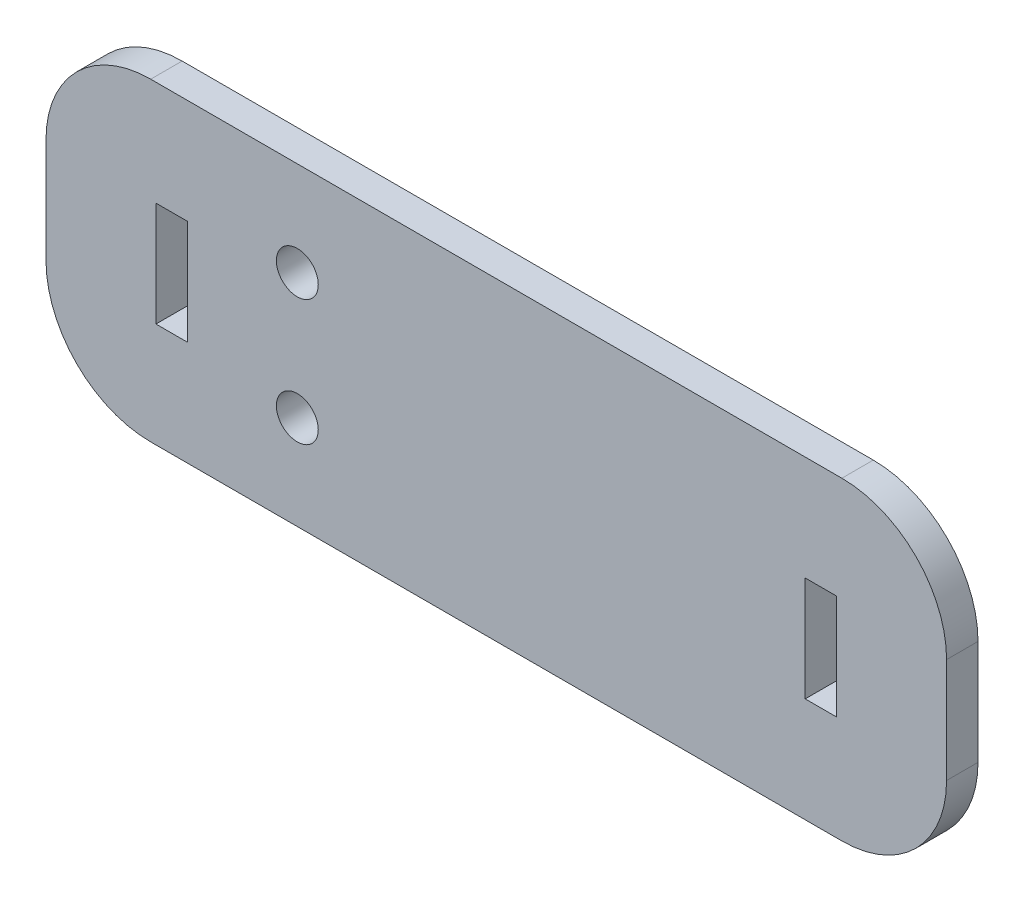
ISO-10303-21;
HEADER;
FILE_DESCRIPTION(('STEP AP214'),'2;1');
FILE_NAME('part.step','',(''),(''),'','','');
FILE_SCHEMA(('AUTOMOTIVE_DESIGN { 1 0 10303 214 1 1 1 1 }'));
ENDSEC;
DATA;
#1=APPLICATION_CONTEXT('core data for automotive mechanical design processes');
#2=APPLICATION_PROTOCOL_DEFINITION('international standard','automotive_design',2000,#1);
#3=PRODUCT_CONTEXT('',#1,'mechanical');
#4=PRODUCT('Part','Part','',(#3));
#5=PRODUCT_RELATED_PRODUCT_CATEGORY('part','',(#4));
#6=PRODUCT_DEFINITION_FORMATION('','',#4);
#7=PRODUCT_DEFINITION_CONTEXT('part definition',#1,'design');
#8=PRODUCT_DEFINITION('design','',#6,#7);
#9=PRODUCT_DEFINITION_SHAPE('','',#8);
#10=(LENGTH_UNIT() NAMED_UNIT(*) SI_UNIT(.MILLI.,.METRE.));
#11=(NAMED_UNIT(*) PLANE_ANGLE_UNIT() SI_UNIT($,.RADIAN.));
#12=(NAMED_UNIT(*) SI_UNIT($,.STERADIAN.) SOLID_ANGLE_UNIT());
#13=UNCERTAINTY_MEASURE_WITH_UNIT(LENGTH_MEASURE(1.E-05),#10,'distance_accuracy_value','');
#14=(GEOMETRIC_REPRESENTATION_CONTEXT(3) GLOBAL_UNCERTAINTY_ASSIGNED_CONTEXT((#13)) GLOBAL_UNIT_ASSIGNED_CONTEXT((#10,
#11,#12)) REPRESENTATION_CONTEXT('',''));
#15=CARTESIAN_POINT('',(0.,0.,0.));
#16=DIRECTION('',(0.,0.,1.));
#17=DIRECTION('',(1.,0.,0.));
#18=AXIS2_PLACEMENT_3D('',#15,#16,#17);
#19=CARTESIAN_POINT('',(43.,15.,3.));
#20=DIRECTION('',(-1.,0.,0.));
#21=DIRECTION('',(0.,-1.,0.));
#22=AXIS2_PLACEMENT_3D('',#19,#20,#21);
#23=PLANE('',#22);
#24=DIRECTION('',(0.,1.,0.));
#25=VECTOR('',#24,1.);
#26=CARTESIAN_POINT('',(43.,15.,3.));
#27=LINE('',#26,#25);
#28=CARTESIAN_POINT('',(43.,-5.,3.));
#29=VERTEX_POINT('',#28);
#30=CARTESIAN_POINT('',(43.,5.,3.));
#31=VERTEX_POINT('',#30);
#32=EDGE_CURVE('E270',#29,#31,#27,.T.);
#33=ORIENTED_EDGE('',*,*,#32,.F.);
#34=DIRECTION('',(0.,0.,-1.));
#35=VECTOR('',#34,1.);
#36=CARTESIAN_POINT('',(43.,-5.,3.));
#37=LINE('',#36,#35);
#38=CARTESIAN_POINT('',(43.,-5.,0.));
#39=VERTEX_POINT('',#38);
#40=EDGE_CURVE('E301',#29,#39,#37,.T.);
#41=ORIENTED_EDGE('',*,*,#40,.T.);
#42=DIRECTION('',(0.,1.,0.));
#43=VECTOR('',#42,1.);
#44=CARTESIAN_POINT('',(43.,15.,0.));
#45=LINE('',#44,#43);
#46=CARTESIAN_POINT('',(43.,5.,0.));
#47=VERTEX_POINT('',#46);
#48=EDGE_CURVE('E178',#39,#47,#45,.T.);
#49=ORIENTED_EDGE('',*,*,#48,.T.);
#50=DIRECTION('',(0.,0.,-1.));
#51=VECTOR('',#50,1.);
#52=CARTESIAN_POINT('',(43.,5.,3.));
#53=LINE('',#52,#51);
#54=EDGE_CURVE('E285',#47,#31,#53,.F.);
#55=ORIENTED_EDGE('',*,*,#54,.T.);
#56=EDGE_LOOP('',(#33,#41,#49,#55));
#57=FACE_BOUND('',#56,.T.);
#58=ADVANCED_FACE('F42',(#57),#23,.F.);
#59=CARTESIAN_POINT('',(-43.,15.,3.));
#60=DIRECTION('',(0.,-1.,0.));
#61=DIRECTION('',(0.,0.,-1.));
#62=AXIS2_PLACEMENT_3D('',#59,#60,#61);
#63=PLANE('',#62);
#64=DIRECTION('',(-1.,0.,0.));
#65=VECTOR('',#64,1.);
#66=CARTESIAN_POINT('',(-43.,15.,3.));
#67=LINE('',#66,#65);
#68=CARTESIAN_POINT('',(33.,15.,3.));
#69=VERTEX_POINT('',#68);
#70=CARTESIAN_POINT('',(-33.,15.,3.));
#71=VERTEX_POINT('',#70);
#72=EDGE_CURVE('E274',#69,#71,#67,.T.);
#73=ORIENTED_EDGE('',*,*,#72,.F.);
#74=DIRECTION('',(0.,0.,-1.));
#75=VECTOR('',#74,1.);
#76=CARTESIAN_POINT('',(33.,15.,3.));
#77=LINE('',#76,#75);
#78=CARTESIAN_POINT('',(33.,15.,0.));
#79=VERTEX_POINT('',#78);
#80=EDGE_CURVE('E338',#69,#79,#77,.T.);
#81=ORIENTED_EDGE('',*,*,#80,.T.);
#82=DIRECTION('',(-1.,0.,0.));
#83=VECTOR('',#82,1.);
#84=CARTESIAN_POINT('',(-43.,15.,0.));
#85=LINE('',#84,#83);
#86=CARTESIAN_POINT('',(-33.,15.,0.));
#87=VERTEX_POINT('',#86);
#88=EDGE_CURVE('E289',#79,#87,#85,.T.);
#89=ORIENTED_EDGE('',*,*,#88,.T.);
#90=DIRECTION('',(0.,0.,-1.));
#91=VECTOR('',#90,1.);
#92=CARTESIAN_POINT('',(-33.,15.,3.));
#93=LINE('',#92,#91);
#94=EDGE_CURVE('E335',#87,#71,#93,.F.);
#95=ORIENTED_EDGE('',*,*,#94,.T.);
#96=EDGE_LOOP('',(#73,#81,#89,#95));
#97=FACE_BOUND('',#96,.T.);
#98=ADVANCED_FACE('F373',(#97),#63,.F.);
#99=CARTESIAN_POINT('',(-43.,15.,3.));
#100=DIRECTION('',(1.,0.,0.));
#101=DIRECTION('',(0.,0.,-1.));
#102=AXIS2_PLACEMENT_3D('',#99,#100,#101);
#103=PLANE('',#102);
#104=DIRECTION('',(0.,-1.,0.));
#105=VECTOR('',#104,1.);
#106=CARTESIAN_POINT('',(-43.,15.,0.));
#107=LINE('',#106,#105);
#108=CARTESIAN_POINT('',(-43.,5.,0.));
#109=VERTEX_POINT('',#108);
#110=CARTESIAN_POINT('',(-43.,-5.,0.));
#111=VERTEX_POINT('',#110);
#112=EDGE_CURVE('E293',#109,#111,#107,.T.);
#113=ORIENTED_EDGE('',*,*,#112,.T.);
#114=DIRECTION('',(0.,0.,-1.));
#115=VECTOR('',#114,1.);
#116=CARTESIAN_POINT('',(-43.,-5.,3.));
#117=LINE('',#116,#115);
#118=CARTESIAN_POINT('',(-43.,-5.,3.));
#119=VERTEX_POINT('',#118);
#120=EDGE_CURVE('E11',#111,#119,#117,.F.);
#121=ORIENTED_EDGE('',*,*,#120,.T.);
#122=DIRECTION('',(0.,-1.,0.));
#123=VECTOR('',#122,1.);
#124=CARTESIAN_POINT('',(-43.,15.,3.));
#125=LINE('',#124,#123);
#126=CARTESIAN_POINT('',(-43.,5.,3.));
#127=VERTEX_POINT('',#126);
#128=EDGE_CURVE('E278',#127,#119,#125,.T.);
#129=ORIENTED_EDGE('',*,*,#128,.F.);
#130=DIRECTION('',(0.,0.,-1.));
#131=VECTOR('',#130,1.);
#132=CARTESIAN_POINT('',(-43.,5.,3.));
#133=LINE('',#132,#131);
#134=EDGE_CURVE('E51',#127,#109,#133,.T.);
#135=ORIENTED_EDGE('',*,*,#134,.T.);
#136=EDGE_LOOP('',(#113,#121,#129,#135));
#137=FACE_BOUND('',#136,.T.);
#138=ADVANCED_FACE('F345',(#137),#103,.F.);
#139=CARTESIAN_POINT('',(-43.,-15.,3.));
#140=DIRECTION('',(0.,1.,0.));
#141=DIRECTION('',(0.,0.,1.));
#142=AXIS2_PLACEMENT_3D('',#139,#140,#141);
#143=PLANE('',#142);
#144=DIRECTION('',(1.,0.,0.));
#145=VECTOR('',#144,1.);
#146=CARTESIAN_POINT('',(-43.,-15.,0.));
#147=LINE('',#146,#145);
#148=CARTESIAN_POINT('',(-33.,-15.,0.));
#149=VERTEX_POINT('',#148);
#150=CARTESIAN_POINT('',(33.,-15.,0.));
#151=VERTEX_POINT('',#150);
#152=EDGE_CURVE('E275',#149,#151,#147,.T.);
#153=ORIENTED_EDGE('',*,*,#152,.T.);
#154=DIRECTION('',(0.,0.,-1.));
#155=VECTOR('',#154,1.);
#156=CARTESIAN_POINT('',(33.,-15.,3.));
#157=LINE('',#156,#155);
#158=CARTESIAN_POINT('',(33.,-15.,3.));
#159=VERTEX_POINT('',#158);
#160=EDGE_CURVE('E321',#151,#159,#157,.F.);
#161=ORIENTED_EDGE('',*,*,#160,.T.);
#162=DIRECTION('',(1.,0.,0.));
#163=VECTOR('',#162,1.);
#164=CARTESIAN_POINT('',(-43.,-15.,3.));
#165=LINE('',#164,#163);
#166=CARTESIAN_POINT('',(-33.,-15.,3.));
#167=VERTEX_POINT('',#166);
#168=EDGE_CURVE('E281',#167,#159,#165,.T.);
#169=ORIENTED_EDGE('',*,*,#168,.F.);
#170=DIRECTION('',(0.,0.,-1.));
#171=VECTOR('',#170,1.);
#172=CARTESIAN_POINT('',(-33.,-15.,3.));
#173=LINE('',#172,#171);
#174=EDGE_CURVE('E317',#167,#149,#173,.T.);
#175=ORIENTED_EDGE('',*,*,#174,.T.);
#176=EDGE_LOOP('',(#153,#161,#169,#175));
#177=FACE_BOUND('',#176,.T.);
#178=ADVANCED_FACE('F357',(#177),#143,.F.);
#179=CARTESIAN_POINT('',(0.,0.,3.));
#180=DIRECTION('',(0.,0.,1.));
#181=DIRECTION('',(1.,0.,0.));
#182=AXIS2_PLACEMENT_3D('',#179,#180,#181);
#183=PLANE('',#182);
#184=DIRECTION('',(0.,1.,0.));
#185=VECTOR('',#184,1.);
#186=CARTESIAN_POINT('',(-29.5,5.,3.));
#187=LINE('',#186,#185);
#188=CARTESIAN_POINT('',(-29.5,-5.,3.));
#189=VERTEX_POINT('',#188);
#190=CARTESIAN_POINT('',(-29.5,5.,3.));
#191=VERTEX_POINT('',#190);
#192=EDGE_CURVE('E163',#189,#191,#187,.T.);
#193=ORIENTED_EDGE('',*,*,#192,.F.);
#194=DIRECTION('',(1.,0.,0.));
#195=VECTOR('',#194,1.);
#196=CARTESIAN_POINT('',(-32.5,-5.,3.));
#197=LINE('',#196,#195);
#198=CARTESIAN_POINT('',(-32.5,-5.,3.));
#199=VERTEX_POINT('',#198);
#200=EDGE_CURVE('E169',#199,#189,#197,.T.);
#201=ORIENTED_EDGE('',*,*,#200,.F.);
#202=DIRECTION('',(0.,-1.,0.));
#203=VECTOR('',#202,1.);
#204=CARTESIAN_POINT('',(-32.5,5.,3.));
#205=LINE('',#204,#203);
#206=CARTESIAN_POINT('',(-32.5,5.,3.));
#207=VERTEX_POINT('',#206);
#208=EDGE_CURVE('E197',#207,#199,#205,.T.);
#209=ORIENTED_EDGE('',*,*,#208,.F.);
#210=DIRECTION('',(-1.,0.,0.));
#211=VECTOR('',#210,1.);
#212=CARTESIAN_POINT('',(-32.5,5.,3.));
#213=LINE('',#212,#211);
#214=EDGE_CURVE('E189',#191,#207,#213,.T.);
#215=ORIENTED_EDGE('',*,*,#214,.F.);
#216=EDGE_LOOP('',(#193,#201,#209,#215));
#217=FACE_BOUND('',#216,.T.);
#218=CARTESIAN_POINT('',(-19.,-6.,3.));
#219=DIRECTION('',(0.,0.,1.));
#220=DIRECTION('',(1.,0.,0.));
#221=AXIS2_PLACEMENT_3D('',#218,#219,#220);
#222=CIRCLE('',#221,2.);
#223=CARTESIAN_POINT('',(-17.,-6.,3.));
#224=VERTEX_POINT('',#223);
#225=EDGE_CURVE('E215',#224,#224,#222,.T.);
#226=ORIENTED_EDGE('',*,*,#225,.F.);
#227=EDGE_LOOP('',(#226));
#228=FACE_BOUND('',#227,.T.);
#229=CARTESIAN_POINT('',(-19.,6.,3.));
#230=DIRECTION('',(0.,0.,1.));
#231=DIRECTION('',(1.,0.,0.));
#232=AXIS2_PLACEMENT_3D('',#229,#230,#231);
#233=CIRCLE('',#232,2.);
#234=CARTESIAN_POINT('',(-17.,6.,3.));
#235=VERTEX_POINT('',#234);
#236=EDGE_CURVE('E225',#235,#235,#233,.T.);
#237=ORIENTED_EDGE('',*,*,#236,.F.);
#238=EDGE_LOOP('',(#237));
#239=FACE_BOUND('',#238,.T.);
#240=DIRECTION('',(0.,1.,0.));
#241=VECTOR('',#240,1.);
#242=CARTESIAN_POINT('',(32.5,5.00000000000001,3.));
#243=LINE('',#242,#241);
#244=CARTESIAN_POINT('',(32.5,-4.99999999999999,3.));
#245=VERTEX_POINT('',#244);
#246=CARTESIAN_POINT('',(32.5,5.00000000000001,3.));
#247=VERTEX_POINT('',#246);
#248=EDGE_CURVE('E250',#245,#247,#243,.T.);
#249=ORIENTED_EDGE('',*,*,#248,.F.);
#250=DIRECTION('',(1.,0.,0.));
#251=VECTOR('',#250,1.);
#252=CARTESIAN_POINT('',(32.5,-4.99999999999999,3.));
#253=LINE('',#252,#251);
#254=CARTESIAN_POINT('',(29.5,-5.,3.));
#255=VERTEX_POINT('',#254);
#256=EDGE_CURVE('E230',#255,#245,#253,.T.);
#257=ORIENTED_EDGE('',*,*,#256,.F.);
#258=DIRECTION('',(0.,-1.,0.));
#259=VECTOR('',#258,1.);
#260=CARTESIAN_POINT('',(29.5,5.,3.));
#261=LINE('',#260,#259);
#262=CARTESIAN_POINT('',(29.5,5.,3.));
#263=VERTEX_POINT('',#262);
#264=EDGE_CURVE('E242',#263,#255,#261,.T.);
#265=ORIENTED_EDGE('',*,*,#264,.F.);
#266=DIRECTION('',(-1.,0.,0.));
#267=VECTOR('',#266,1.);
#268=CARTESIAN_POINT('',(32.5,5.00000000000001,3.));
#269=LINE('',#268,#267);
#270=EDGE_CURVE('E246',#247,#263,#269,.T.);
#271=ORIENTED_EDGE('',*,*,#270,.F.);
#272=EDGE_LOOP('',(#249,#257,#265,#271));
#273=FACE_BOUND('',#272,.T.);
#274=ORIENTED_EDGE('',*,*,#168,.T.);
#275=CARTESIAN_POINT('',(33.,-5.,3.));
#276=DIRECTION('',(0.,0.,1.));
#277=DIRECTION('',(1.,0.,0.));
#278=AXIS2_PLACEMENT_3D('',#275,#276,#277);
#279=CIRCLE('',#278,10.);
#280=EDGE_CURVE('E332',#159,#29,#279,.T.);
#281=ORIENTED_EDGE('',*,*,#280,.T.);
#282=ORIENTED_EDGE('',*,*,#32,.T.);
#283=CARTESIAN_POINT('',(33.,5.,3.));
#284=DIRECTION('',(0.,0.,1.));
#285=DIRECTION('',(1.,0.,0.));
#286=AXIS2_PLACEMENT_3D('',#283,#284,#285);
#287=CIRCLE('',#286,10.);
#288=EDGE_CURVE('E329',#31,#69,#287,.T.);
#289=ORIENTED_EDGE('',*,*,#288,.T.);
#290=ORIENTED_EDGE('',*,*,#72,.T.);
#291=CARTESIAN_POINT('',(-33.,5.,3.));
#292=DIRECTION('',(0.,0.,1.));
#293=DIRECTION('',(1.,0.,0.));
#294=AXIS2_PLACEMENT_3D('',#291,#292,#293);
#295=CIRCLE('',#294,10.);
#296=EDGE_CURVE('E63',#71,#127,#295,.T.);
#297=ORIENTED_EDGE('',*,*,#296,.T.);
#298=ORIENTED_EDGE('',*,*,#128,.T.);
#299=CARTESIAN_POINT('',(-33.,-5.,3.));
#300=DIRECTION('',(0.,0.,1.));
#301=DIRECTION('',(1.,0.,0.));
#302=AXIS2_PLACEMENT_3D('',#299,#300,#301);
#303=CIRCLE('',#302,10.);
#304=EDGE_CURVE('E326',#119,#167,#303,.T.);
#305=ORIENTED_EDGE('',*,*,#304,.T.);
#306=EDGE_LOOP('',(#274,#281,#282,#289,#290,#297,#298,#305));
#307=FACE_BOUND('',#306,.T.);
#308=ADVANCED_FACE('F360',(#217,#228,#239,#273,#307),#183,.T.);
#309=CARTESIAN_POINT('',(0.,0.,0.));
#310=DIRECTION('',(0.,0.,1.));
#311=DIRECTION('',(1.,0.,0.));
#312=AXIS2_PLACEMENT_3D('',#309,#310,#311);
#313=PLANE('',#312);
#314=DIRECTION('',(-1.,0.,0.));
#315=VECTOR('',#314,1.);
#316=CARTESIAN_POINT('',(-32.5,-5.,0.));
#317=LINE('',#316,#315);
#318=CARTESIAN_POINT('',(-29.5,-5.,0.));
#319=VERTEX_POINT('',#318);
#320=CARTESIAN_POINT('',(-32.5,-5.,0.));
#321=VERTEX_POINT('',#320);
#322=EDGE_CURVE('E184',#319,#321,#317,.T.);
#323=ORIENTED_EDGE('',*,*,#322,.F.);
#324=DIRECTION('',(0.,-1.,0.));
#325=VECTOR('',#324,1.);
#326=CARTESIAN_POINT('',(-29.5,5.,0.));
#327=LINE('',#326,#325);
#328=CARTESIAN_POINT('',(-29.5,5.,0.));
#329=VERTEX_POINT('',#328);
#330=EDGE_CURVE('E160',#329,#319,#327,.T.);
#331=ORIENTED_EDGE('',*,*,#330,.F.);
#332=DIRECTION('',(1.,0.,0.));
#333=VECTOR('',#332,1.);
#334=CARTESIAN_POINT('',(-32.5,5.,0.));
#335=LINE('',#334,#333);
#336=CARTESIAN_POINT('',(-32.5,5.,0.));
#337=VERTEX_POINT('',#336);
#338=EDGE_CURVE('E173',#337,#329,#335,.T.);
#339=ORIENTED_EDGE('',*,*,#338,.F.);
#340=DIRECTION('',(0.,1.,0.));
#341=VECTOR('',#340,1.);
#342=CARTESIAN_POINT('',(-32.5,5.,0.));
#343=LINE('',#342,#341);
#344=EDGE_CURVE('E191',#321,#337,#343,.T.);
#345=ORIENTED_EDGE('',*,*,#344,.F.);
#346=EDGE_LOOP('',(#323,#331,#339,#345));
#347=FACE_BOUND('',#346,.T.);
#348=CARTESIAN_POINT('',(-19.,-6.,0.));
#349=DIRECTION('',(0.,0.,1.));
#350=DIRECTION('',(1.,0.,0.));
#351=AXIS2_PLACEMENT_3D('',#348,#349,#350);
#352=CIRCLE('',#351,2.);
#353=CARTESIAN_POINT('',(-17.,-6.,0.));
#354=VERTEX_POINT('',#353);
#355=EDGE_CURVE('E211',#354,#354,#352,.F.);
#356=ORIENTED_EDGE('',*,*,#355,.F.);
#357=EDGE_LOOP('',(#356));
#358=FACE_BOUND('',#357,.T.);
#359=CARTESIAN_POINT('',(-19.,6.,0.));
#360=DIRECTION('',(0.,0.,1.));
#361=DIRECTION('',(1.,0.,0.));
#362=AXIS2_PLACEMENT_3D('',#359,#360,#361);
#363=CIRCLE('',#362,2.);
#364=CARTESIAN_POINT('',(-17.,6.,0.));
#365=VERTEX_POINT('',#364);
#366=EDGE_CURVE('E219',#365,#365,#363,.F.);
#367=ORIENTED_EDGE('',*,*,#366,.F.);
#368=EDGE_LOOP('',(#367));
#369=FACE_BOUND('',#368,.T.);
#370=DIRECTION('',(-1.,0.,0.));
#371=VECTOR('',#370,1.);
#372=CARTESIAN_POINT('',(32.5,-4.99999999999999,0.));
#373=LINE('',#372,#371);
#374=CARTESIAN_POINT('',(32.5,-4.99999999999999,0.));
#375=VERTEX_POINT('',#374);
#376=CARTESIAN_POINT('',(29.5,-5.,0.));
#377=VERTEX_POINT('',#376);
#378=EDGE_CURVE('E257',#375,#377,#373,.T.);
#379=ORIENTED_EDGE('',*,*,#378,.F.);
#380=DIRECTION('',(0.,-1.,0.));
#381=VECTOR('',#380,1.);
#382=CARTESIAN_POINT('',(32.5,5.00000000000001,0.));
#383=LINE('',#382,#381);
#384=CARTESIAN_POINT('',(32.5,5.00000000000001,0.));
#385=VERTEX_POINT('',#384);
#386=EDGE_CURVE('E253',#385,#375,#383,.T.);
#387=ORIENTED_EDGE('',*,*,#386,.F.);
#388=DIRECTION('',(1.,0.,0.));
#389=VECTOR('',#388,1.);
#390=CARTESIAN_POINT('',(32.5,5.00000000000001,0.));
#391=LINE('',#390,#389);
#392=CARTESIAN_POINT('',(29.5,5.,0.));
#393=VERTEX_POINT('',#392);
#394=EDGE_CURVE('E220',#393,#385,#391,.T.);
#395=ORIENTED_EDGE('',*,*,#394,.F.);
#396=DIRECTION('',(0.,1.,0.));
#397=VECTOR('',#396,1.);
#398=CARTESIAN_POINT('',(29.5,5.,0.));
#399=LINE('',#398,#397);
#400=EDGE_CURVE('E261',#377,#393,#399,.T.);
#401=ORIENTED_EDGE('',*,*,#400,.F.);
#402=EDGE_LOOP('',(#379,#387,#395,#401));
#403=FACE_BOUND('',#402,.T.);
#404=ORIENTED_EDGE('',*,*,#48,.F.);
#405=CARTESIAN_POINT('',(33.,-5.,0.));
#406=DIRECTION('',(0.,0.,1.));
#407=DIRECTION('',(1.,0.,0.));
#408=AXIS2_PLACEMENT_3D('',#405,#406,#407);
#409=CIRCLE('',#408,10.);
#410=EDGE_CURVE('E314',#39,#151,#409,.F.);
#411=ORIENTED_EDGE('',*,*,#410,.T.);
#412=ORIENTED_EDGE('',*,*,#152,.F.);
#413=CARTESIAN_POINT('',(-33.,-5.,0.));
#414=DIRECTION('',(0.,0.,1.));
#415=DIRECTION('',(1.,0.,0.));
#416=AXIS2_PLACEMENT_3D('',#413,#414,#415);
#417=CIRCLE('',#416,10.);
#418=EDGE_CURVE('E308',#149,#111,#417,.F.);
#419=ORIENTED_EDGE('',*,*,#418,.T.);
#420=ORIENTED_EDGE('',*,*,#112,.F.);
#421=CARTESIAN_POINT('',(-33.,5.,0.));
#422=DIRECTION('',(0.,0.,1.));
#423=DIRECTION('',(1.,0.,0.));
#424=AXIS2_PLACEMENT_3D('',#421,#422,#423);
#425=CIRCLE('',#424,10.);
#426=EDGE_CURVE('E305',#109,#87,#425,.F.);
#427=ORIENTED_EDGE('',*,*,#426,.T.);
#428=ORIENTED_EDGE('',*,*,#88,.F.);
#429=CARTESIAN_POINT('',(33.,5.,0.));
#430=DIRECTION('',(0.,0.,1.));
#431=DIRECTION('',(1.,0.,0.));
#432=AXIS2_PLACEMENT_3D('',#429,#430,#431);
#433=CIRCLE('',#432,10.);
#434=EDGE_CURVE('E311',#79,#47,#433,.F.);
#435=ORIENTED_EDGE('',*,*,#434,.T.);
#436=EDGE_LOOP('',(#404,#411,#412,#419,#420,#427,#428,#435));
#437=FACE_BOUND('',#436,.T.);
#438=ADVANCED_FACE('F181',(#347,#358,#369,#403,#437),#313,.F.);
#439=CARTESIAN_POINT('',(32.5,5.00000000000001,-0.00100000000000013));
#440=DIRECTION('',(1.,0.,0.));
#441=DIRECTION('',(0.,0.,-1.));
#442=AXIS2_PLACEMENT_3D('',#439,#440,#441);
#443=PLANE('',#442);
#444=ORIENTED_EDGE('',*,*,#386,.T.);
#445=DIRECTION('',(0.,0.,1.));
#446=VECTOR('',#445,1.);
#447=CARTESIAN_POINT('',(32.5,-4.99999999999999,-0.00100000000000013));
#448=LINE('',#447,#446);
#449=EDGE_CURVE('E224',#375,#245,#448,.T.);
#450=ORIENTED_EDGE('',*,*,#449,.T.);
#451=ORIENTED_EDGE('',*,*,#248,.T.);
#452=DIRECTION('',(0.,0.,1.));
#453=VECTOR('',#452,1.);
#454=CARTESIAN_POINT('',(32.5,5.00000000000001,-0.00100000000000013));
#455=LINE('',#454,#453);
#456=EDGE_CURVE('E226',#385,#247,#455,.T.);
#457=ORIENTED_EDGE('',*,*,#456,.F.);
#458=EDGE_LOOP('',(#444,#450,#451,#457));
#459=FACE_BOUND('',#458,.T.);
#460=ADVANCED_FACE('F501',(#459),#443,.F.);
#461=CARTESIAN_POINT('',(32.5,-4.99999999999999,-0.00100000000000013));
#462=DIRECTION('',(0.,-1.,0.));
#463=DIRECTION('',(1.,0.,0.));
#464=AXIS2_PLACEMENT_3D('',#461,#462,#463);
#465=PLANE('',#464);
#466=ORIENTED_EDGE('',*,*,#378,.T.);
#467=DIRECTION('',(0.,0.,1.));
#468=VECTOR('',#467,1.);
#469=CARTESIAN_POINT('',(29.5,-5.,-0.00100000000000013));
#470=LINE('',#469,#468);
#471=EDGE_CURVE('E234',#377,#255,#470,.T.);
#472=ORIENTED_EDGE('',*,*,#471,.T.);
#473=ORIENTED_EDGE('',*,*,#256,.T.);
#474=ORIENTED_EDGE('',*,*,#449,.F.);
#475=EDGE_LOOP('',(#466,#472,#473,#474));
#476=FACE_BOUND('',#475,.T.);
#477=ADVANCED_FACE('F491',(#476),#465,.F.);
#478=CARTESIAN_POINT('',(29.5,5.,-0.00100000000000013));
#479=DIRECTION('',(-1.,0.,0.));
#480=DIRECTION('',(0.,0.,1.));
#481=AXIS2_PLACEMENT_3D('',#478,#479,#480);
#482=PLANE('',#481);
#483=ORIENTED_EDGE('',*,*,#400,.T.);
#484=DIRECTION('',(0.,0.,1.));
#485=VECTOR('',#484,1.);
#486=CARTESIAN_POINT('',(29.5,5.,-0.00100000000000013));
#487=LINE('',#486,#485);
#488=EDGE_CURVE('E231',#393,#263,#487,.T.);
#489=ORIENTED_EDGE('',*,*,#488,.T.);
#490=ORIENTED_EDGE('',*,*,#264,.T.);
#491=ORIENTED_EDGE('',*,*,#471,.F.);
#492=EDGE_LOOP('',(#483,#489,#490,#491));
#493=FACE_BOUND('',#492,.T.);
#494=ADVANCED_FACE('F481',(#493),#482,.F.);
#495=CARTESIAN_POINT('',(32.5,5.00000000000001,-0.00100000000000013));
#496=DIRECTION('',(0.,1.,0.));
#497=DIRECTION('',(-1.,0.,0.));
#498=AXIS2_PLACEMENT_3D('',#495,#496,#497);
#499=PLANE('',#498);
#500=ORIENTED_EDGE('',*,*,#394,.T.);
#501=ORIENTED_EDGE('',*,*,#456,.T.);
#502=ORIENTED_EDGE('',*,*,#270,.T.);
#503=ORIENTED_EDGE('',*,*,#488,.F.);
#504=EDGE_LOOP('',(#500,#501,#502,#503));
#505=FACE_BOUND('',#504,.T.);
#506=ADVANCED_FACE('F471',(#505),#499,.F.);
#507=CARTESIAN_POINT('',(-19.,6.,-0.00100000000000013));
#508=DIRECTION('',(0.,0.,1.));
#509=DIRECTION('',(1.,0.,0.));
#510=AXIS2_PLACEMENT_3D('',#507,#508,#509);
#511=CYLINDRICAL_SURFACE('',#510,2.);
#512=ORIENTED_EDGE('',*,*,#236,.T.);
#513=EDGE_LOOP('',(#512));
#514=FACE_BOUND('',#513,.T.);
#515=ORIENTED_EDGE('',*,*,#366,.T.);
#516=EDGE_LOOP('',(#515));
#517=FACE_BOUND('',#516,.T.);
#518=ADVANCED_FACE('F461',(#514,#517),#511,.F.);
#519=CARTESIAN_POINT('',(-19.,-6.,-0.00100000000000013));
#520=DIRECTION('',(0.,0.,1.));
#521=DIRECTION('',(1.,0.,0.));
#522=AXIS2_PLACEMENT_3D('',#519,#520,#521);
#523=CYLINDRICAL_SURFACE('',#522,2.);
#524=ORIENTED_EDGE('',*,*,#225,.T.);
#525=EDGE_LOOP('',(#524));
#526=FACE_BOUND('',#525,.T.);
#527=ORIENTED_EDGE('',*,*,#355,.T.);
#528=EDGE_LOOP('',(#527));
#529=FACE_BOUND('',#528,.T.);
#530=ADVANCED_FACE('F452',(#526,#529),#523,.F.);
#531=CARTESIAN_POINT('',(-29.5,5.,-0.00100000000000013));
#532=DIRECTION('',(1.,0.,0.));
#533=DIRECTION('',(0.,0.,-1.));
#534=AXIS2_PLACEMENT_3D('',#531,#532,#533);
#535=PLANE('',#534);
#536=ORIENTED_EDGE('',*,*,#330,.T.);
#537=DIRECTION('',(0.,0.,1.));
#538=VECTOR('',#537,1.);
#539=CARTESIAN_POINT('',(-29.5,-5.,-0.00100000000000013));
#540=LINE('',#539,#538);
#541=EDGE_CURVE('E179',#319,#189,#540,.T.);
#542=ORIENTED_EDGE('',*,*,#541,.T.);
#543=ORIENTED_EDGE('',*,*,#192,.T.);
#544=DIRECTION('',(0.,0.,1.));
#545=VECTOR('',#544,1.);
#546=CARTESIAN_POINT('',(-29.5,5.,-0.00100000000000013));
#547=LINE('',#546,#545);
#548=EDGE_CURVE('E156',#329,#191,#547,.T.);
#549=ORIENTED_EDGE('',*,*,#548,.F.);
#550=EDGE_LOOP('',(#536,#542,#543,#549));
#551=FACE_BOUND('',#550,.T.);
#552=ADVANCED_FACE('F158',(#551),#535,.F.);
#553=CARTESIAN_POINT('',(-32.5,-5.,-0.00100000000000013));
#554=DIRECTION('',(0.,-1.,0.));
#555=DIRECTION('',(0.,0.,-1.));
#556=AXIS2_PLACEMENT_3D('',#553,#554,#555);
#557=PLANE('',#556);
#558=ORIENTED_EDGE('',*,*,#322,.T.);
#559=DIRECTION('',(0.,0.,1.));
#560=VECTOR('',#559,1.);
#561=CARTESIAN_POINT('',(-32.5,-5.,-0.00100000000000013));
#562=LINE('',#561,#560);
#563=EDGE_CURVE('E206',#321,#199,#562,.T.);
#564=ORIENTED_EDGE('',*,*,#563,.T.);
#565=ORIENTED_EDGE('',*,*,#200,.T.);
#566=ORIENTED_EDGE('',*,*,#541,.F.);
#567=EDGE_LOOP('',(#558,#564,#565,#566));
#568=FACE_BOUND('',#567,.T.);
#569=ADVANCED_FACE('F433',(#568),#557,.F.);
#570=CARTESIAN_POINT('',(-32.5,5.,-0.00100000000000013));
#571=DIRECTION('',(-1.,0.,0.));
#572=DIRECTION('',(0.,-1.,0.));
#573=AXIS2_PLACEMENT_3D('',#570,#571,#572);
#574=PLANE('',#573);
#575=ORIENTED_EDGE('',*,*,#344,.T.);
#576=DIRECTION('',(0.,0.,1.));
#577=VECTOR('',#576,1.);
#578=CARTESIAN_POINT('',(-32.5,5.,-0.00100000000000013));
#579=LINE('',#578,#577);
#580=EDGE_CURVE('E168',#337,#207,#579,.T.);
#581=ORIENTED_EDGE('',*,*,#580,.T.);
#582=ORIENTED_EDGE('',*,*,#208,.T.);
#583=ORIENTED_EDGE('',*,*,#563,.F.);
#584=EDGE_LOOP('',(#575,#581,#582,#583));
#585=FACE_BOUND('',#584,.T.);
#586=ADVANCED_FACE('F424',(#585),#574,.F.);
#587=CARTESIAN_POINT('',(-32.5,5.,-0.00100000000000013));
#588=DIRECTION('',(0.,1.,0.));
#589=DIRECTION('',(0.,0.,1.));
#590=AXIS2_PLACEMENT_3D('',#587,#588,#589);
#591=PLANE('',#590);
#592=ORIENTED_EDGE('',*,*,#338,.T.);
#593=ORIENTED_EDGE('',*,*,#548,.T.);
#594=ORIENTED_EDGE('',*,*,#214,.T.);
#595=ORIENTED_EDGE('',*,*,#580,.F.);
#596=EDGE_LOOP('',(#592,#593,#594,#595));
#597=FACE_BOUND('',#596,.T.);
#598=ADVANCED_FACE('F174',(#597),#591,.F.);
#599=CARTESIAN_POINT('',(33.,-5.,3.));
#600=DIRECTION('',(0.,0.,-1.));
#601=DIRECTION('',(-1.,0.,0.));
#602=AXIS2_PLACEMENT_3D('',#599,#600,#601);
#603=CYLINDRICAL_SURFACE('',#602,10.);
#604=ORIENTED_EDGE('',*,*,#280,.F.);
#605=ORIENTED_EDGE('',*,*,#160,.F.);
#606=ORIENTED_EDGE('',*,*,#410,.F.);
#607=ORIENTED_EDGE('',*,*,#40,.F.);
#608=EDGE_LOOP('',(#604,#605,#606,#607));
#609=FACE_BOUND('',#608,.T.);
#610=ADVANCED_FACE('F364',(#609),#603,.T.);
#611=CARTESIAN_POINT('',(33.,5.,3.));
#612=DIRECTION('',(0.,0.,-1.));
#613=DIRECTION('',(-1.,0.,0.));
#614=AXIS2_PLACEMENT_3D('',#611,#612,#613);
#615=CYLINDRICAL_SURFACE('',#614,10.);
#616=ORIENTED_EDGE('',*,*,#288,.F.);
#617=ORIENTED_EDGE('',*,*,#54,.F.);
#618=ORIENTED_EDGE('',*,*,#434,.F.);
#619=ORIENTED_EDGE('',*,*,#80,.F.);
#620=EDGE_LOOP('',(#616,#617,#618,#619));
#621=FACE_BOUND('',#620,.T.);
#622=ADVANCED_FACE('F370',(#621),#615,.T.);
#623=CARTESIAN_POINT('',(-33.,-5.,3.));
#624=DIRECTION('',(0.,0.,-1.));
#625=DIRECTION('',(-1.,0.,0.));
#626=AXIS2_PLACEMENT_3D('',#623,#624,#625);
#627=CYLINDRICAL_SURFACE('',#626,10.);
#628=ORIENTED_EDGE('',*,*,#304,.F.);
#629=ORIENTED_EDGE('',*,*,#120,.F.);
#630=ORIENTED_EDGE('',*,*,#418,.F.);
#631=ORIENTED_EDGE('',*,*,#174,.F.);
#632=EDGE_LOOP('',(#628,#629,#630,#631));
#633=FACE_BOUND('',#632,.T.);
#634=ADVANCED_FACE('F354',(#633),#627,.T.);
#635=CARTESIAN_POINT('',(-33.,5.,3.));
#636=DIRECTION('',(0.,0.,-1.));
#637=DIRECTION('',(-1.,0.,0.));
#638=AXIS2_PLACEMENT_3D('',#635,#636,#637);
#639=CYLINDRICAL_SURFACE('',#638,10.);
#640=ORIENTED_EDGE('',*,*,#296,.F.);
#641=ORIENTED_EDGE('',*,*,#94,.F.);
#642=ORIENTED_EDGE('',*,*,#426,.F.);
#643=ORIENTED_EDGE('',*,*,#134,.F.);
#644=EDGE_LOOP('',(#640,#641,#642,#643));
#645=FACE_BOUND('',#644,.T.);
#646=ADVANCED_FACE('F44',(#645),#639,.T.);
#647=CLOSED_SHELL('',(#58,#98,#138,#178,#308,#438,#460,#477,#494,#506,#518,#530,#552,#569,#586,
#598,#610,#622,#634,#646));
#648=MANIFOLD_SOLID_BREP('B2',#647);
#649=ADVANCED_BREP_SHAPE_REPRESENTATION('',(#18,#648),#14);
#650=SHAPE_DEFINITION_REPRESENTATION(#9,#649);
ENDSEC;
END-ISO-10303-21;
